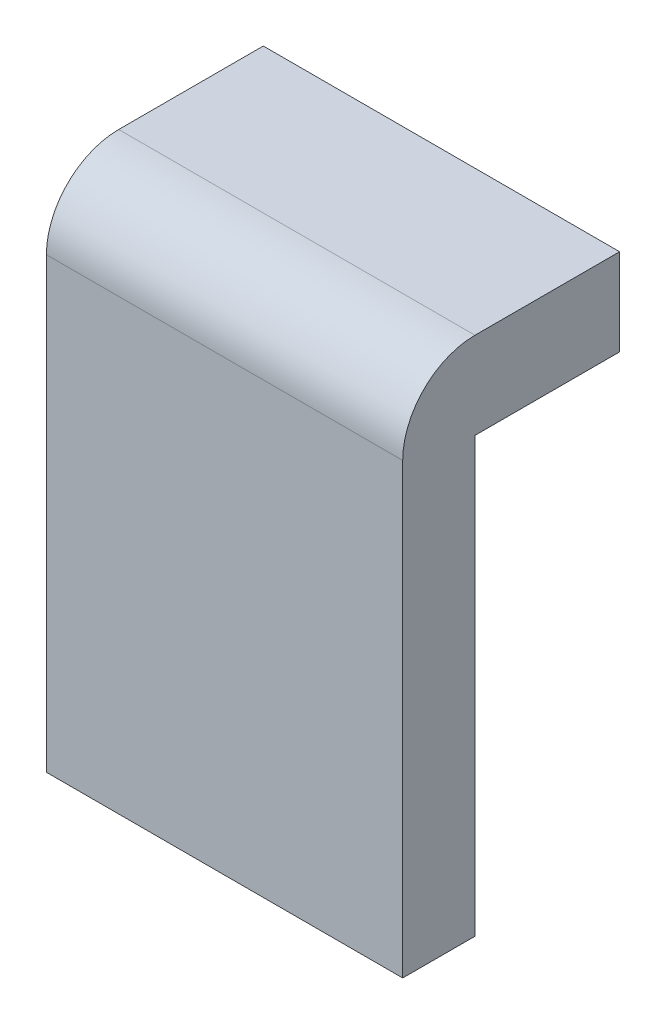
ISO-10303-21;
HEADER;
FILE_DESCRIPTION(('STEP AP214'),'2;1');
FILE_NAME('part.step','',(''),(''),'','','');
FILE_SCHEMA(('AUTOMOTIVE_DESIGN { 1 0 10303 214 1 1 1 1 }'));
ENDSEC;
DATA;
#1=APPLICATION_CONTEXT('core data for automotive mechanical design processes');
#2=APPLICATION_PROTOCOL_DEFINITION('international standard','automotive_design',2000,#1);
#3=PRODUCT_CONTEXT('',#1,'mechanical');
#4=PRODUCT('Part','Part','',(#3));
#5=PRODUCT_RELATED_PRODUCT_CATEGORY('part','',(#4));
#6=PRODUCT_DEFINITION_FORMATION('','',#4);
#7=PRODUCT_DEFINITION_CONTEXT('part definition',#1,'design');
#8=PRODUCT_DEFINITION('design','',#6,#7);
#9=PRODUCT_DEFINITION_SHAPE('','',#8);
#10=(LENGTH_UNIT() NAMED_UNIT(*) SI_UNIT(.MILLI.,.METRE.));
#11=(NAMED_UNIT(*) PLANE_ANGLE_UNIT() SI_UNIT($,.RADIAN.));
#12=(NAMED_UNIT(*) SI_UNIT($,.STERADIAN.) SOLID_ANGLE_UNIT());
#13=UNCERTAINTY_MEASURE_WITH_UNIT(LENGTH_MEASURE(1.E-05),#10,'distance_accuracy_value','');
#14=(GEOMETRIC_REPRESENTATION_CONTEXT(3) GLOBAL_UNCERTAINTY_ASSIGNED_CONTEXT((#13)) GLOBAL_UNIT_ASSIGNED_CONTEXT((#10,
#11,#12)) REPRESENTATION_CONTEXT('',''));
#15=CARTESIAN_POINT('',(0.,0.,0.));
#16=DIRECTION('',(0.,0.,1.));
#17=DIRECTION('',(1.,0.,0.));
#18=AXIS2_PLACEMENT_3D('',#15,#16,#17);
#19=CARTESIAN_POINT('',(-8.34906661620967,8.30000000000001,12.2546737770755));
#20=DIRECTION('',(0.,0.,1.));
#21=DIRECTION('',(0.,-1.,0.));
#22=AXIS2_PLACEMENT_3D('',#19,#20,#21);
#23=PLANE('',#22);
#24=DIRECTION('',(1.,0.,0.));
#25=VECTOR('',#24,1.);
#26=CARTESIAN_POINT('',(-15.8147962412963,6.80000000000003,12.2546737770755));
#27=LINE('',#26,#25);
#28=CARTESIAN_POINT('',(4.14560885986157,6.80000000000003,12.2546737770755));
#29=VERTEX_POINT('',#28);
#30=CARTESIAN_POINT('',(5.3777596163023,6.80000000000003,12.2546737770755));
#31=VERTEX_POINT('',#30);
#32=EDGE_CURVE('E113',#29,#31,#27,.T.);
#33=ORIENTED_EDGE('',*,*,#32,.F.);
#34=DIRECTION('',(0.,1.,0.));
#35=VECTOR('',#34,1.);
#36=CARTESIAN_POINT('',(4.14560885986157,5.35753839337147,12.2546737770755));
#37=LINE('',#36,#35);
#38=CARTESIAN_POINT('',(4.14560885986157,8.30000000000001,12.2546737770755));
#39=VERTEX_POINT('',#38);
#40=EDGE_CURVE('E148',#39,#29,#37,.F.);
#41=ORIENTED_EDGE('',*,*,#40,.F.);
#42=DIRECTION('',(1.,0.,0.));
#43=VECTOR('',#42,1.);
#44=CARTESIAN_POINT('',(-8.34906661620967,8.30000000000001,12.2546737770755));
#45=LINE('',#44,#43);
#46=CARTESIAN_POINT('',(5.3777596163023,8.30000000000001,12.2546737770755));
#47=VERTEX_POINT('',#46);
#48=EDGE_CURVE('E133',#39,#47,#45,.T.);
#49=ORIENTED_EDGE('',*,*,#48,.T.);
#50=DIRECTION('',(0.,1.,0.));
#51=VECTOR('',#50,1.);
#52=CARTESIAN_POINT('',(5.3777596163023,5.35753839337147,12.2546737770755));
#53=LINE('',#52,#51);
#54=EDGE_CURVE('E105',#31,#47,#53,.T.);
#55=ORIENTED_EDGE('',*,*,#54,.F.);
#56=EDGE_LOOP('',(#33,#41,#49,#55));
#57=FACE_BOUND('',#56,.T.);
#58=ADVANCED_FACE('F17',(#57),#23,.F.);
#59=CARTESIAN_POINT('',(-8.34906661620967,8.30000000000001,11.7546737770755));
#60=DIRECTION('',(0.,1.,0.));
#61=DIRECTION('',(0.,0.,1.));
#62=AXIS2_PLACEMENT_3D('',#59,#60,#61);
#63=PLANE('',#62);
#64=ORIENTED_EDGE('',*,*,#48,.F.);
#65=DIRECTION('',(0.,0.,1.));
#66=VECTOR('',#65,1.);
#67=CARTESIAN_POINT('',(4.14560885986157,8.30000000000001,12.5046737770755));
#68=LINE('',#67,#66);
#69=CARTESIAN_POINT('',(4.14560885986157,8.30000000000001,11.7546737770755));
#70=VERTEX_POINT('',#69);
#71=EDGE_CURVE('E153',#70,#39,#68,.T.);
#72=ORIENTED_EDGE('',*,*,#71,.F.);
#73=DIRECTION('',(1.,0.,0.));
#74=VECTOR('',#73,1.);
#75=CARTESIAN_POINT('',(4.14560885986157,8.30000000000001,11.7546737770755));
#76=LINE('',#75,#74);
#77=CARTESIAN_POINT('',(5.3777596163023,8.30000000000001,11.7546737770755));
#78=VERTEX_POINT('',#77);
#79=EDGE_CURVE('E124',#78,#70,#76,.F.);
#80=ORIENTED_EDGE('',*,*,#79,.F.);
#81=DIRECTION('',(0.,0.,-1.));
#82=VECTOR('',#81,1.);
#83=CARTESIAN_POINT('',(5.3777596163023,8.30000000000001,12.5046737770755));
#84=LINE('',#83,#82);
#85=EDGE_CURVE('E129',#47,#78,#84,.T.);
#86=ORIENTED_EDGE('',*,*,#85,.F.);
#87=EDGE_LOOP('',(#64,#72,#80,#86));
#88=FACE_BOUND('',#87,.T.);
#89=ADVANCED_FACE('F175',(#88),#63,.F.);
#90=CARTESIAN_POINT('',(4.14560885986157,5.35753839337146,11.7546737770755));
#91=DIRECTION('',(0.,0.,-1.));
#92=DIRECTION('',(0.,1.,0.));
#93=AXIS2_PLACEMENT_3D('',#90,#91,#92);
#94=PLANE('',#93);
#95=ORIENTED_EDGE('',*,*,#79,.T.);
#96=DIRECTION('',(0.,1.,0.));
#97=VECTOR('',#96,1.);
#98=CARTESIAN_POINT('',(4.14560885986157,5.35753839337147,11.7546737770755));
#99=LINE('',#98,#97);
#100=CARTESIAN_POINT('',(4.14560885986157,8.6,11.7546737770755));
#101=VERTEX_POINT('',#100);
#102=EDGE_CURVE('E119',#101,#70,#99,.F.);
#103=ORIENTED_EDGE('',*,*,#102,.F.);
#104=DIRECTION('',(1.,0.,0.));
#105=VECTOR('',#104,1.);
#106=CARTESIAN_POINT('',(-8.34906661620967,8.6,11.7546737770755));
#107=LINE('',#106,#105);
#108=CARTESIAN_POINT('',(5.3777596163023,8.6,11.7546737770755));
#109=VERTEX_POINT('',#108);
#110=EDGE_CURVE('E122',#101,#109,#107,.T.);
#111=ORIENTED_EDGE('',*,*,#110,.T.);
#112=DIRECTION('',(0.,1.,0.));
#113=VECTOR('',#112,1.);
#114=CARTESIAN_POINT('',(5.3777596163023,5.35753839337147,11.7546737770755));
#115=LINE('',#114,#113);
#116=EDGE_CURVE('E97',#78,#109,#115,.T.);
#117=ORIENTED_EDGE('',*,*,#116,.F.);
#118=EDGE_LOOP('',(#95,#103,#111,#117));
#119=FACE_BOUND('',#118,.T.);
#120=ADVANCED_FACE('F172',(#119),#94,.T.);
#121=CARTESIAN_POINT('',(-8.34906661620967,8.6,11.7546737770755));
#122=DIRECTION('',(0.,-1.,0.));
#123=DIRECTION('',(0.,0.,-1.));
#124=AXIS2_PLACEMENT_3D('',#121,#122,#123);
#125=PLANE('',#124);
#126=ORIENTED_EDGE('',*,*,#110,.F.);
#127=DIRECTION('',(0.,0.,1.));
#128=VECTOR('',#127,1.);
#129=CARTESIAN_POINT('',(4.14560885986157,8.6,12.5046737770755));
#130=LINE('',#129,#128);
#131=CARTESIAN_POINT('',(4.14560885986157,8.6,12.2546737770755));
#132=VERTEX_POINT('',#131);
#133=EDGE_CURVE('E83',#132,#101,#130,.F.);
#134=ORIENTED_EDGE('',*,*,#133,.F.);
#135=DIRECTION('',(1.,0.,0.));
#136=VECTOR('',#135,1.);
#137=CARTESIAN_POINT('',(-8.34906661620967,8.6,12.2546737770755));
#138=LINE('',#137,#136);
#139=CARTESIAN_POINT('',(5.3777596163023,8.6,12.2546737770755));
#140=VERTEX_POINT('',#139);
#141=EDGE_CURVE('E79',#140,#132,#138,.F.);
#142=ORIENTED_EDGE('',*,*,#141,.F.);
#143=DIRECTION('',(0.,0.,-1.));
#144=VECTOR('',#143,1.);
#145=CARTESIAN_POINT('',(5.3777596163023,8.6,12.5046737770755));
#146=LINE('',#145,#144);
#147=EDGE_CURVE('E94',#109,#140,#146,.F.);
#148=ORIENTED_EDGE('',*,*,#147,.F.);
#149=EDGE_LOOP('',(#126,#134,#142,#148));
#150=FACE_BOUND('',#149,.T.);
#151=ADVANCED_FACE('F168',(#150),#125,.F.);
#152=CARTESIAN_POINT('',(-8.34906661620967,8.35,12.2546737770755));
#153=DIRECTION('',(1.,0.,0.));
#154=DIRECTION('',(0.,0.,-1.));
#155=AXIS2_PLACEMENT_3D('',#152,#153,#154);
#156=CYLINDRICAL_SURFACE('',#155,0.249999999999995);
#157=CARTESIAN_POINT('',(4.14560885986157,8.35,12.2546737770755));
#158=DIRECTION('',(1.,0.,0.));
#159=DIRECTION('',(0.,0.,-1.));
#160=AXIS2_PLACEMENT_3D('',#157,#158,#159);
#161=CIRCLE('',#160,0.249999999999995);
#162=CARTESIAN_POINT('',(4.14560885986157,8.35,12.5046737770755));
#163=VERTEX_POINT('',#162);
#164=EDGE_CURVE('E20',#163,#132,#161,.F.);
#165=ORIENTED_EDGE('',*,*,#164,.F.);
#166=DIRECTION('',(1.,0.,0.));
#167=VECTOR('',#166,1.);
#168=CARTESIAN_POINT('',(4.14560885986157,8.35,12.5046737770755));
#169=LINE('',#168,#167);
#170=CARTESIAN_POINT('',(5.3777596163023,8.35,12.5046737770755));
#171=VERTEX_POINT('',#170);
#172=EDGE_CURVE('E77',#171,#163,#169,.F.);
#173=ORIENTED_EDGE('',*,*,#172,.F.);
#174=CARTESIAN_POINT('',(5.3777596163023,8.35,12.2546737770755));
#175=DIRECTION('',(1.,0.,0.));
#176=DIRECTION('',(0.,0.,-1.));
#177=AXIS2_PLACEMENT_3D('',#174,#175,#176);
#178=CIRCLE('',#177,0.249999999999995);
#179=EDGE_CURVE('E106',#140,#171,#178,.T.);
#180=ORIENTED_EDGE('',*,*,#179,.F.);
#181=ORIENTED_EDGE('',*,*,#141,.T.);
#182=EDGE_LOOP('',(#165,#173,#180,#181));
#183=FACE_BOUND('',#182,.T.);
#184=ADVANCED_FACE('F74',(#183),#156,.T.);
#185=CARTESIAN_POINT('',(4.14560885986157,5.35753839337147,12.5046737770755));
#186=DIRECTION('',(-1.,0.,0.));
#187=DIRECTION('',(0.,0.,1.));
#188=AXIS2_PLACEMENT_3D('',#185,#186,#187);
#189=PLANE('',#188);
#190=DIRECTION('',(0.,0.,-1.));
#191=VECTOR('',#190,1.);
#192=CARTESIAN_POINT('',(4.14560885986157,6.80000000000003,12.5046737770755));
#193=LINE('',#192,#191);
#194=CARTESIAN_POINT('',(4.14560885986157,6.80000000000003,12.5046737770755));
#195=VERTEX_POINT('',#194);
#196=EDGE_CURVE('E89',#195,#29,#193,.T.);
#197=ORIENTED_EDGE('',*,*,#196,.F.);
#198=DIRECTION('',(0.,-1.,0.));
#199=VECTOR('',#198,1.);
#200=CARTESIAN_POINT('',(4.14560885986157,5.35753839337147,12.5046737770755));
#201=LINE('',#200,#199);
#202=EDGE_CURVE('E85',#163,#195,#201,.T.);
#203=ORIENTED_EDGE('',*,*,#202,.F.);
#204=ORIENTED_EDGE('',*,*,#164,.T.);
#205=ORIENTED_EDGE('',*,*,#133,.T.);
#206=ORIENTED_EDGE('',*,*,#102,.T.);
#207=ORIENTED_EDGE('',*,*,#71,.T.);
#208=ORIENTED_EDGE('',*,*,#40,.T.);
#209=EDGE_LOOP('',(#197,#203,#204,#205,#206,#207,#208));
#210=FACE_BOUND('',#209,.T.);
#211=ADVANCED_FACE('F86',(#210),#189,.T.);
#212=CARTESIAN_POINT('',(-15.8147962412963,6.80000000000003,12.5046737770755));
#213=DIRECTION('',(0.,-1.,0.));
#214=DIRECTION('',(0.,0.,-1.));
#215=AXIS2_PLACEMENT_3D('',#212,#213,#214);
#216=PLANE('',#215);
#217=DIRECTION('',(1.,0.,0.));
#218=VECTOR('',#217,1.);
#219=CARTESIAN_POINT('',(4.14560885986157,6.80000000000003,12.5046737770755));
#220=LINE('',#219,#218);
#221=CARTESIAN_POINT('',(5.3777596163023,6.80000000000003,12.5046737770755));
#222=VERTEX_POINT('',#221);
#223=EDGE_CURVE('E26',#195,#222,#220,.T.);
#224=ORIENTED_EDGE('',*,*,#223,.F.);
#225=ORIENTED_EDGE('',*,*,#196,.T.);
#226=ORIENTED_EDGE('',*,*,#32,.T.);
#227=DIRECTION('',(0.,0.,-1.));
#228=VECTOR('',#227,1.);
#229=CARTESIAN_POINT('',(5.3777596163023,6.80000000000003,12.5046737770755));
#230=LINE('',#229,#228);
#231=EDGE_CURVE('E35',#222,#31,#230,.T.);
#232=ORIENTED_EDGE('',*,*,#231,.F.);
#233=EDGE_LOOP('',(#224,#225,#226,#232));
#234=FACE_BOUND('',#233,.T.);
#235=ADVANCED_FACE('F179',(#234),#216,.T.);
#236=CARTESIAN_POINT('',(5.3777596163023,5.35753839337147,12.5046737770755));
#237=DIRECTION('',(1.,0.,0.));
#238=DIRECTION('',(0.,0.,-1.));
#239=AXIS2_PLACEMENT_3D('',#236,#237,#238);
#240=PLANE('',#239);
#241=ORIENTED_EDGE('',*,*,#116,.T.);
#242=ORIENTED_EDGE('',*,*,#147,.T.);
#243=ORIENTED_EDGE('',*,*,#179,.T.);
#244=DIRECTION('',(0.,-1.,0.));
#245=VECTOR('',#244,1.);
#246=CARTESIAN_POINT('',(5.3777596163023,5.35753839337147,12.5046737770755));
#247=LINE('',#246,#245);
#248=EDGE_CURVE('E11',#222,#171,#247,.F.);
#249=ORIENTED_EDGE('',*,*,#248,.F.);
#250=ORIENTED_EDGE('',*,*,#231,.T.);
#251=ORIENTED_EDGE('',*,*,#54,.T.);
#252=ORIENTED_EDGE('',*,*,#85,.T.);
#253=EDGE_LOOP('',(#241,#242,#243,#249,#250,#251,#252));
#254=FACE_BOUND('',#253,.T.);
#255=ADVANCED_FACE('F164',(#254),#240,.T.);
#256=CARTESIAN_POINT('',(4.14560885986157,5.35753839337147,12.5046737770755));
#257=DIRECTION('',(0.,0.,1.));
#258=DIRECTION('',(0.,-1.,0.));
#259=AXIS2_PLACEMENT_3D('',#256,#257,#258);
#260=PLANE('',#259);
#261=ORIENTED_EDGE('',*,*,#223,.T.);
#262=ORIENTED_EDGE('',*,*,#248,.T.);
#263=ORIENTED_EDGE('',*,*,#172,.T.);
#264=ORIENTED_EDGE('',*,*,#202,.T.);
#265=EDGE_LOOP('',(#261,#262,#263,#264));
#266=FACE_BOUND('',#265,.T.);
#267=ADVANCED_FACE('F93',(#266),#260,.T.);
#268=CLOSED_SHELL('',(#58,#89,#120,#151,#184,#211,#235,#255,#267));
#269=MANIFOLD_SOLID_BREP('B1',#268);
#270=ADVANCED_BREP_SHAPE_REPRESENTATION('',(#18,#269),#14);
#271=SHAPE_DEFINITION_REPRESENTATION(#9,#270);
ENDSEC;
END-ISO-10303-21;
